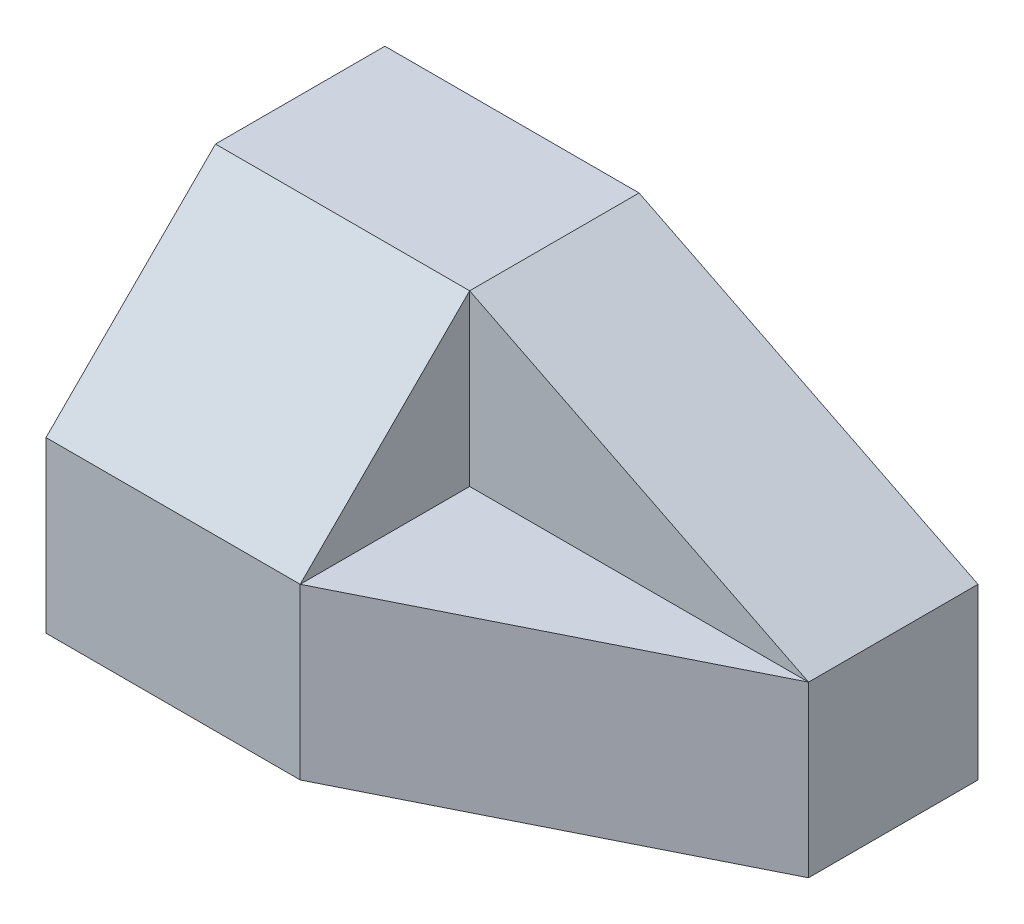
ISO-10303-21;
HEADER;
FILE_DESCRIPTION(('STEP AP214'),'2;1');
FILE_NAME('part.step','',(''),(''),'','','');
FILE_SCHEMA(('AUTOMOTIVE_DESIGN { 1 0 10303 214 1 1 1 1 }'));
ENDSEC;
DATA;
#1=APPLICATION_CONTEXT('core data for automotive mechanical design processes');
#2=APPLICATION_PROTOCOL_DEFINITION('international standard','automotive_design',2000,#1);
#3=PRODUCT_CONTEXT('',#1,'mechanical');
#4=PRODUCT('Part','Part','',(#3));
#5=PRODUCT_RELATED_PRODUCT_CATEGORY('part','',(#4));
#6=PRODUCT_DEFINITION_FORMATION('','',#4);
#7=PRODUCT_DEFINITION_CONTEXT('part definition',#1,'design');
#8=PRODUCT_DEFINITION('design','',#6,#7);
#9=PRODUCT_DEFINITION_SHAPE('','',#8);
#10=(LENGTH_UNIT() NAMED_UNIT(*) SI_UNIT(.MILLI.,.METRE.));
#11=(NAMED_UNIT(*) PLANE_ANGLE_UNIT() SI_UNIT($,.RADIAN.));
#12=(NAMED_UNIT(*) SI_UNIT($,.STERADIAN.) SOLID_ANGLE_UNIT());
#13=UNCERTAINTY_MEASURE_WITH_UNIT(LENGTH_MEASURE(1.E-05),#10,'distance_accuracy_value','');
#14=(GEOMETRIC_REPRESENTATION_CONTEXT(3) GLOBAL_UNCERTAINTY_ASSIGNED_CONTEXT((#13)) GLOBAL_UNIT_ASSIGNED_CONTEXT((#10,
#11,#12)) REPRESENTATION_CONTEXT('',''));
#15=CARTESIAN_POINT('',(0.,0.,0.));
#16=DIRECTION('',(0.,0.,1.));
#17=DIRECTION('',(1.,0.,0.));
#18=AXIS2_PLACEMENT_3D('',#15,#16,#17);
#19=CARTESIAN_POINT('',(17.5,20.,10.));
#20=DIRECTION('',(-1.,0.,0.));
#21=DIRECTION('',(0.,0.,1.));
#22=AXIS2_PLACEMENT_3D('',#19,#20,#21);
#23=PLANE('',#22);
#24=DIRECTION('',(0.,-1.,0.));
#25=VECTOR('',#24,1.);
#26=CARTESIAN_POINT('',(17.5,32.,0.));
#27=LINE('',#26,#25);
#28=CARTESIAN_POINT('',(17.5,10.,0.));
#29=VERTEX_POINT('',#28);
#30=CARTESIAN_POINT('',(17.5,0.,0.));
#31=VERTEX_POINT('',#30);
#32=EDGE_CURVE('E128',#29,#31,#27,.T.);
#33=ORIENTED_EDGE('',*,*,#32,.T.);
#34=DIRECTION('',(0.,0.,-1.));
#35=VECTOR('',#34,1.);
#36=CARTESIAN_POINT('',(17.5,0.,10.));
#37=LINE('',#36,#35);
#38=CARTESIAN_POINT('',(17.5,0.,-10.));
#39=VERTEX_POINT('',#38);
#40=EDGE_CURVE('E126',#31,#39,#37,.T.);
#41=ORIENTED_EDGE('',*,*,#40,.T.);
#42=DIRECTION('',(0.,-1.,0.));
#43=VECTOR('',#42,1.);
#44=CARTESIAN_POINT('',(17.5,20.,-10.));
#45=LINE('',#44,#43);
#46=CARTESIAN_POINT('',(17.5,10.,-10.));
#47=VERTEX_POINT('',#46);
#48=EDGE_CURVE('E11',#47,#39,#45,.T.);
#49=ORIENTED_EDGE('',*,*,#48,.F.);
#50=DIRECTION('',(0.,0.,1.));
#51=VECTOR('',#50,1.);
#52=CARTESIAN_POINT('',(17.5,10.,-10.));
#53=LINE('',#52,#51);
#54=EDGE_CURVE('E123',#47,#29,#53,.T.);
#55=ORIENTED_EDGE('',*,*,#54,.T.);
#56=EDGE_LOOP('',(#33,#41,#49,#55));
#57=FACE_BOUND('',#56,.T.);
#58=ADVANCED_FACE('F33',(#57),#23,.F.);
#59=CARTESIAN_POINT('',(-17.5,20.,10.));
#60=DIRECTION('',(0.,0.,-1.));
#61=DIRECTION('',(-1.,0.,0.));
#62=AXIS2_PLACEMENT_3D('',#59,#60,#61);
#63=PLANE('',#62);
#64=DIRECTION('',(0.,-1.,0.));
#65=VECTOR('',#64,1.);
#66=CARTESIAN_POINT('',(-2.49999999999999,32.,10.));
#67=LINE('',#66,#65);
#68=CARTESIAN_POINT('',(-2.49999999999999,10.,10.));
#69=VERTEX_POINT('',#68);
#70=CARTESIAN_POINT('',(-2.49999999999999,0.,10.));
#71=VERTEX_POINT('',#70);
#72=EDGE_CURVE('E160',#69,#71,#67,.T.);
#73=ORIENTED_EDGE('',*,*,#72,.F.);
#74=DIRECTION('',(1.,0.,0.));
#75=VECTOR('',#74,1.);
#76=CARTESIAN_POINT('',(-21.5,10.,10.));
#77=LINE('',#76,#75);
#78=CARTESIAN_POINT('',(-17.5,10.,10.));
#79=VERTEX_POINT('',#78);
#80=EDGE_CURVE('E47',#79,#69,#77,.T.);
#81=ORIENTED_EDGE('',*,*,#80,.F.);
#82=DIRECTION('',(0.,-1.,0.));
#83=VECTOR('',#82,1.);
#84=CARTESIAN_POINT('',(-17.5,20.,10.));
#85=LINE('',#84,#83);
#86=CARTESIAN_POINT('',(-17.5,0.,10.));
#87=VERTEX_POINT('',#86);
#88=EDGE_CURVE('E135',#79,#87,#85,.T.);
#89=ORIENTED_EDGE('',*,*,#88,.T.);
#90=DIRECTION('',(1.,0.,0.));
#91=VECTOR('',#90,1.);
#92=CARTESIAN_POINT('',(-17.5,0.,10.));
#93=LINE('',#92,#91);
#94=EDGE_CURVE('E133',#87,#71,#93,.T.);
#95=ORIENTED_EDGE('',*,*,#94,.T.);
#96=EDGE_LOOP('',(#73,#81,#89,#95));
#97=FACE_BOUND('',#96,.T.);
#98=ADVANCED_FACE('F159',(#97),#63,.F.);
#99=CARTESIAN_POINT('',(0.,0.,0.));
#100=DIRECTION('',(0.,-1.,0.));
#101=DIRECTION('',(0.,0.,-1.));
#102=AXIS2_PLACEMENT_3D('',#99,#100,#101);
#103=PLANE('',#102);
#104=ORIENTED_EDGE('',*,*,#40,.F.);
#105=DIRECTION('',(-0.894427190999916,0.,0.447213595499958));
#106=VECTOR('',#105,1.);
#107=CARTESIAN_POINT('',(17.5,0.,0.));
#108=LINE('',#107,#106);
#109=EDGE_CURVE('E117',#31,#71,#108,.T.);
#110=ORIENTED_EDGE('',*,*,#109,.T.);
#111=ORIENTED_EDGE('',*,*,#94,.F.);
#112=DIRECTION('',(0.,0.,1.));
#113=VECTOR('',#112,1.);
#114=CARTESIAN_POINT('',(-17.5,0.,10.));
#115=LINE('',#114,#113);
#116=CARTESIAN_POINT('',(-17.5,0.,-10.));
#117=VERTEX_POINT('',#116);
#118=EDGE_CURVE('E139',#117,#87,#115,.T.);
#119=ORIENTED_EDGE('',*,*,#118,.F.);
#120=DIRECTION('',(-1.,0.,0.));
#121=VECTOR('',#120,1.);
#122=CARTESIAN_POINT('',(-17.5,0.,-10.));
#123=LINE('',#122,#121);
#124=EDGE_CURVE('E137',#39,#117,#123,.T.);
#125=ORIENTED_EDGE('',*,*,#124,.F.);
#126=EDGE_LOOP('',(#104,#110,#111,#119,#125));
#127=FACE_BOUND('',#126,.T.);
#128=ADVANCED_FACE('F155',(#127),#103,.T.);
#129=CARTESIAN_POINT('',(-2.49999999999999,20.,-10.));
#130=DIRECTION('',(-0.447213595499958,-0.894427190999916,0.));
#131=DIRECTION('',(0.894427190999916,-0.447213595499958,0.));
#132=AXIS2_PLACEMENT_3D('',#129,#130,#131);
#133=PLANE('',#132);
#134=DIRECTION('',(0.,0.,1.));
#135=VECTOR('',#134,1.);
#136=CARTESIAN_POINT('',(-2.49999999999999,20.,-10.));
#137=LINE('',#136,#135);
#138=CARTESIAN_POINT('',(-2.49999999999999,20.,-10.));
#139=VERTEX_POINT('',#138);
#140=CARTESIAN_POINT('',(-2.49999999999999,20.,0.));
#141=VERTEX_POINT('',#140);
#142=EDGE_CURVE('E103',#139,#141,#137,.T.);
#143=ORIENTED_EDGE('',*,*,#142,.T.);
#144=DIRECTION('',(0.894427190999916,-0.447213595499958,0.));
#145=VECTOR('',#144,1.);
#146=CARTESIAN_POINT('',(-2.49999999999999,20.,0.));
#147=LINE('',#146,#145);
#148=EDGE_CURVE('E110',#141,#29,#147,.T.);
#149=ORIENTED_EDGE('',*,*,#148,.T.);
#150=ORIENTED_EDGE('',*,*,#54,.F.);
#151=DIRECTION('',(0.894427190999916,-0.447213595499958,0.));
#152=VECTOR('',#151,1.);
#153=CARTESIAN_POINT('',(-2.49999999999999,20.,-10.));
#154=LINE('',#153,#152);
#155=EDGE_CURVE('E55',#139,#47,#154,.T.);
#156=ORIENTED_EDGE('',*,*,#155,.F.);
#157=EDGE_LOOP('',(#143,#149,#150,#156));
#158=FACE_BOUND('',#157,.T.);
#159=ADVANCED_FACE('F122',(#158),#133,.F.);
#160=CARTESIAN_POINT('',(-17.5,20.,-10.));
#161=DIRECTION('',(0.,0.,1.));
#162=DIRECTION('',(1.,0.,0.));
#163=AXIS2_PLACEMENT_3D('',#160,#161,#162);
#164=PLANE('',#163);
#165=DIRECTION('',(-1.,0.,0.));
#166=VECTOR('',#165,1.);
#167=CARTESIAN_POINT('',(-17.5,20.,-10.));
#168=LINE('',#167,#166);
#169=CARTESIAN_POINT('',(-17.5,20.,-10.));
#170=VERTEX_POINT('',#169);
#171=EDGE_CURVE('E131',#139,#170,#168,.T.);
#172=ORIENTED_EDGE('',*,*,#171,.F.);
#173=ORIENTED_EDGE('',*,*,#155,.T.);
#174=ORIENTED_EDGE('',*,*,#48,.T.);
#175=ORIENTED_EDGE('',*,*,#124,.T.);
#176=DIRECTION('',(0.,-1.,0.));
#177=VECTOR('',#176,1.);
#178=CARTESIAN_POINT('',(-17.5,20.,-10.));
#179=LINE('',#178,#177);
#180=EDGE_CURVE('E40',#170,#117,#179,.T.);
#181=ORIENTED_EDGE('',*,*,#180,.F.);
#182=EDGE_LOOP('',(#172,#173,#174,#175,#181));
#183=FACE_BOUND('',#182,.T.);
#184=ADVANCED_FACE('F199',(#183),#164,.F.);
#185=CARTESIAN_POINT('',(-17.5,20.,10.));
#186=DIRECTION('',(1.,0.,0.));
#187=DIRECTION('',(0.,0.,-1.));
#188=AXIS2_PLACEMENT_3D('',#185,#186,#187);
#189=PLANE('',#188);
#190=ORIENTED_EDGE('',*,*,#88,.F.);
#191=DIRECTION('',(0.,0.707106781186547,-0.707106781186548));
#192=VECTOR('',#191,1.);
#193=CARTESIAN_POINT('',(-17.5,15.,5.));
#194=LINE('',#193,#192);
#195=CARTESIAN_POINT('',(-17.5,20.,0.));
#196=VERTEX_POINT('',#195);
#197=EDGE_CURVE('E161',#79,#196,#194,.T.);
#198=ORIENTED_EDGE('',*,*,#197,.T.);
#199=DIRECTION('',(0.,0.,1.));
#200=VECTOR('',#199,1.);
#201=CARTESIAN_POINT('',(-17.5,20.,10.));
#202=LINE('',#201,#200);
#203=EDGE_CURVE('E106',#170,#196,#202,.T.);
#204=ORIENTED_EDGE('',*,*,#203,.F.);
#205=ORIENTED_EDGE('',*,*,#180,.T.);
#206=ORIENTED_EDGE('',*,*,#118,.T.);
#207=EDGE_LOOP('',(#190,#198,#204,#205,#206));
#208=FACE_BOUND('',#207,.T.);
#209=ADVANCED_FACE('F149',(#208),#189,.F.);
#210=CARTESIAN_POINT('',(0.,20.,0.));
#211=DIRECTION('',(0.,-1.,0.));
#212=DIRECTION('',(0.,0.,-1.));
#213=AXIS2_PLACEMENT_3D('',#210,#211,#212);
#214=PLANE('',#213);
#215=ORIENTED_EDGE('',*,*,#203,.T.);
#216=DIRECTION('',(1.,0.,0.));
#217=VECTOR('',#216,1.);
#218=CARTESIAN_POINT('',(-21.5,20.,0.));
#219=LINE('',#218,#217);
#220=EDGE_CURVE('E92',#196,#141,#219,.T.);
#221=ORIENTED_EDGE('',*,*,#220,.T.);
#222=ORIENTED_EDGE('',*,*,#142,.F.);
#223=ORIENTED_EDGE('',*,*,#171,.T.);
#224=EDGE_LOOP('',(#215,#221,#222,#223));
#225=FACE_BOUND('',#224,.T.);
#226=ADVANCED_FACE('F102',(#225),#214,.F.);
#227=CARTESIAN_POINT('',(17.5,32.,0.));
#228=DIRECTION('',(0.447213595499958,0.,0.894427190999916));
#229=DIRECTION('',(0.894427190999916,0.,-0.447213595499958));
#230=AXIS2_PLACEMENT_3D('',#227,#228,#229);
#231=PLANE('',#230);
#232=DIRECTION('',(0.894427190999916,0.,-0.447213595499958));
#233=VECTOR('',#232,1.);
#234=CARTESIAN_POINT('',(-2.49999999999999,10.,10.));
#235=LINE('',#234,#233);
#236=EDGE_CURVE('E162',#69,#29,#235,.T.);
#237=ORIENTED_EDGE('',*,*,#236,.F.);
#238=ORIENTED_EDGE('',*,*,#72,.T.);
#239=ORIENTED_EDGE('',*,*,#109,.F.);
#240=ORIENTED_EDGE('',*,*,#32,.F.);
#241=EDGE_LOOP('',(#237,#238,#239,#240));
#242=FACE_BOUND('',#241,.T.);
#243=ADVANCED_FACE('F176',(#242),#231,.T.);
#244=CARTESIAN_POINT('',(17.5,10.,0.));
#245=DIRECTION('',(0.,0.,-1.));
#246=DIRECTION('',(-1.,0.,0.));
#247=AXIS2_PLACEMENT_3D('',#244,#245,#246);
#248=PLANE('',#247);
#249=DIRECTION('',(0.,1.,0.));
#250=VECTOR('',#249,1.);
#251=CARTESIAN_POINT('',(-2.49999999999999,10.,0.));
#252=LINE('',#251,#250);
#253=CARTESIAN_POINT('',(-2.49999999999999,10.,0.));
#254=VERTEX_POINT('',#253);
#255=EDGE_CURVE('E112',#254,#141,#252,.T.);
#256=ORIENTED_EDGE('',*,*,#255,.F.);
#257=DIRECTION('',(-1.,0.,0.));
#258=VECTOR('',#257,1.);
#259=CARTESIAN_POINT('',(17.5,10.,0.));
#260=LINE('',#259,#258);
#261=EDGE_CURVE('E114',#29,#254,#260,.T.);
#262=ORIENTED_EDGE('',*,*,#261,.F.);
#263=ORIENTED_EDGE('',*,*,#148,.F.);
#264=EDGE_LOOP('',(#256,#262,#263));
#265=FACE_BOUND('',#264,.T.);
#266=ADVANCED_FACE('F111',(#265),#248,.F.);
#267=CARTESIAN_POINT('',(-2.49999999999999,10.,0.));
#268=DIRECTION('',(-1.,0.,0.));
#269=DIRECTION('',(0.,0.,1.));
#270=AXIS2_PLACEMENT_3D('',#267,#268,#269);
#271=PLANE('',#270);
#272=ORIENTED_EDGE('',*,*,#255,.T.);
#273=DIRECTION('',(0.,0.707106781186547,-0.707106781186548));
#274=VECTOR('',#273,1.);
#275=CARTESIAN_POINT('',(-2.49999999999999,10.,10.));
#276=LINE('',#275,#274);
#277=EDGE_CURVE('E89',#69,#141,#276,.T.);
#278=ORIENTED_EDGE('',*,*,#277,.F.);
#279=DIRECTION('',(0.,0.,1.));
#280=VECTOR('',#279,1.);
#281=CARTESIAN_POINT('',(-2.49999999999999,10.,0.));
#282=LINE('',#281,#280);
#283=EDGE_CURVE('E120',#254,#69,#282,.T.);
#284=ORIENTED_EDGE('',*,*,#283,.F.);
#285=EDGE_LOOP('',(#272,#278,#284));
#286=FACE_BOUND('',#285,.T.);
#287=ADVANCED_FACE('F119',(#286),#271,.F.);
#288=CARTESIAN_POINT('',(0.,10.,0.));
#289=DIRECTION('',(0.,-1.,0.));
#290=DIRECTION('',(0.,0.,-1.));
#291=AXIS2_PLACEMENT_3D('',#288,#289,#290);
#292=PLANE('',#291);
#293=ORIENTED_EDGE('',*,*,#236,.T.);
#294=ORIENTED_EDGE('',*,*,#261,.T.);
#295=ORIENTED_EDGE('',*,*,#283,.T.);
#296=EDGE_LOOP('',(#293,#294,#295));
#297=FACE_BOUND('',#296,.T.);
#298=ADVANCED_FACE('F178',(#297),#292,.F.);
#299=CARTESIAN_POINT('',(-21.5,10.,10.));
#300=DIRECTION('',(0.,-0.707106781186548,-0.707106781186547));
#301=DIRECTION('',(0.,0.707106781186547,-0.707106781186548));
#302=AXIS2_PLACEMENT_3D('',#299,#300,#301);
#303=PLANE('',#302);
#304=ORIENTED_EDGE('',*,*,#80,.T.);
#305=ORIENTED_EDGE('',*,*,#277,.T.);
#306=ORIENTED_EDGE('',*,*,#220,.F.);
#307=ORIENTED_EDGE('',*,*,#197,.F.);
#308=EDGE_LOOP('',(#304,#305,#306,#307));
#309=FACE_BOUND('',#308,.T.);
#310=ADVANCED_FACE('F91',(#309),#303,.F.);
#311=CLOSED_SHELL('',(#58,#98,#128,#159,#184,#209,#226,#243,#266,#287,#298,#310));
#312=MANIFOLD_SOLID_BREP('B2',#311);
#313=ADVANCED_BREP_SHAPE_REPRESENTATION('',(#18,#312),#14);
#314=SHAPE_DEFINITION_REPRESENTATION(#9,#313);
ENDSEC;
END-ISO-10303-21;
